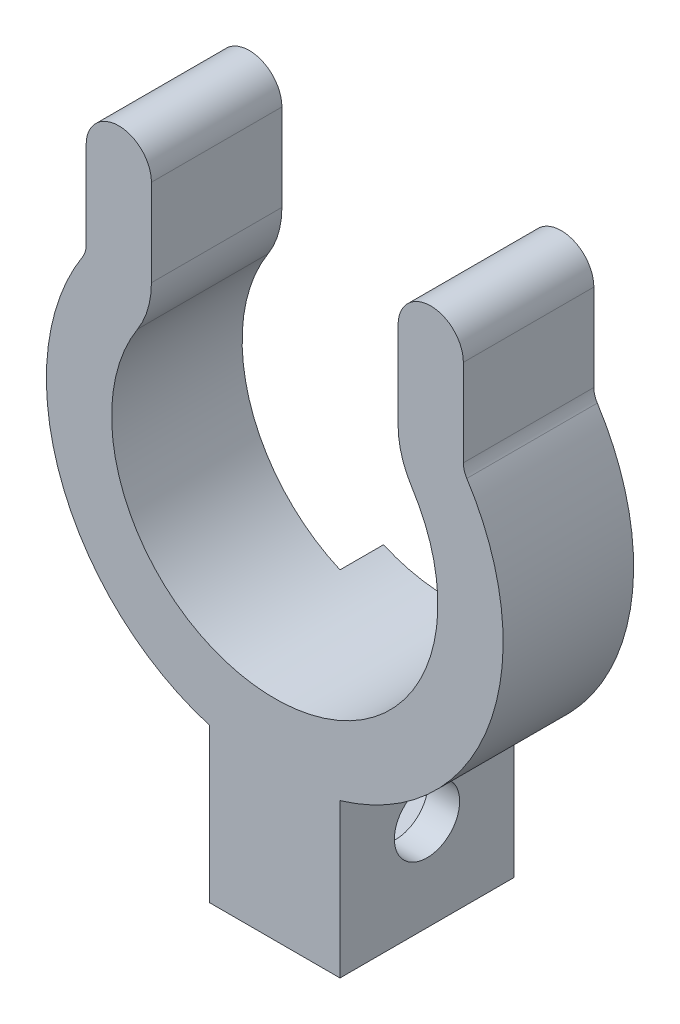
ISO-10303-21;
HEADER;
FILE_DESCRIPTION(('STEP AP214'),'2;1');
FILE_NAME('part.step','',(''),(''),'','','');
FILE_SCHEMA(('AUTOMOTIVE_DESIGN { 1 0 10303 214 1 1 1 1 }'));
ENDSEC;
DATA;
#1=APPLICATION_CONTEXT('core data for automotive mechanical design processes');
#2=APPLICATION_PROTOCOL_DEFINITION('international standard','automotive_design',2000,#1);
#3=PRODUCT_CONTEXT('',#1,'mechanical');
#4=PRODUCT('Part','Part','',(#3));
#5=PRODUCT_RELATED_PRODUCT_CATEGORY('part','',(#4));
#6=PRODUCT_DEFINITION_FORMATION('','',#4);
#7=PRODUCT_DEFINITION_CONTEXT('part definition',#1,'design');
#8=PRODUCT_DEFINITION('design','',#6,#7);
#9=PRODUCT_DEFINITION_SHAPE('','',#8);
#10=(LENGTH_UNIT() NAMED_UNIT(*) SI_UNIT(.MILLI.,.METRE.));
#11=(NAMED_UNIT(*) PLANE_ANGLE_UNIT() SI_UNIT($,.RADIAN.));
#12=(NAMED_UNIT(*) SI_UNIT($,.STERADIAN.) SOLID_ANGLE_UNIT());
#13=UNCERTAINTY_MEASURE_WITH_UNIT(LENGTH_MEASURE(1.E-05),#10,'distance_accuracy_value','');
#14=(GEOMETRIC_REPRESENTATION_CONTEXT(3) GLOBAL_UNCERTAINTY_ASSIGNED_CONTEXT((#13)) GLOBAL_UNIT_ASSIGNED_CONTEXT((#10,
#11,#12)) REPRESENTATION_CONTEXT('',''));
#15=CARTESIAN_POINT('',(0.,0.,0.));
#16=DIRECTION('',(0.,0.,1.));
#17=DIRECTION('',(1.,0.,0.));
#18=AXIS2_PLACEMENT_3D('',#15,#16,#17);
#19=CARTESIAN_POINT('',(0.,0.,6.));
#20=DIRECTION('',(0.,0.,-1.));
#21=DIRECTION('',(-1.,0.,0.));
#22=AXIS2_PLACEMENT_3D('',#19,#20,#21);
#23=CYLINDRICAL_SURFACE('',#22,10.5);
#24=CARTESIAN_POINT('',(0.,0.,6.));
#25=DIRECTION('',(0.,0.,1.));
#26=DIRECTION('',(1.,0.,0.));
#27=AXIS2_PLACEMENT_3D('',#24,#25,#26);
#28=CIRCLE('',#27,10.5);
#29=CARTESIAN_POINT('',(3.,-10.0623058987491,6.));
#30=VERTEX_POINT('',#29);
#31=CARTESIAN_POINT('',(8.83026219841009,5.68123837797093,6.));
#32=VERTEX_POINT('',#31);
#33=EDGE_CURVE('E70',#30,#32,#28,.T.);
#34=ORIENTED_EDGE('',*,*,#33,.F.);
#35=DIRECTION('',(0.,0.,-1.));
#36=VECTOR('',#35,1.);
#37=CARTESIAN_POINT('',(3.,-10.0623058987491,6.));
#38=LINE('',#37,#36);
#39=CARTESIAN_POINT('',(3.,-10.0623058987491,0.));
#40=VERTEX_POINT('',#39);
#41=EDGE_CURVE('E293',#30,#40,#38,.T.);
#42=ORIENTED_EDGE('',*,*,#41,.T.);
#43=CARTESIAN_POINT('',(0.,0.,0.));
#44=DIRECTION('',(0.,0.,1.));
#45=DIRECTION('',(1.,0.,0.));
#46=AXIS2_PLACEMENT_3D('',#43,#44,#45);
#47=CIRCLE('',#46,10.5);
#48=CARTESIAN_POINT('',(8.83026219841009,5.68123837797093,0.));
#49=VERTEX_POINT('',#48);
#50=EDGE_CURVE('E360',#40,#49,#47,.T.);
#51=ORIENTED_EDGE('',*,*,#50,.T.);
#52=DIRECTION('',(0.,0.,-1.));
#53=VECTOR('',#52,1.);
#54=CARTESIAN_POINT('',(8.83026219841009,5.68123837797093,6.));
#55=LINE('',#54,#53);
#56=EDGE_CURVE('E391',#32,#49,#55,.T.);
#57=ORIENTED_EDGE('',*,*,#56,.F.);
#58=EDGE_LOOP('',(#34,#42,#51,#57));
#59=FACE_BOUND('',#58,.T.);
#60=ADVANCED_FACE('F45',(#59),#23,.T.);
#61=CARTESIAN_POINT('',(9.67123955063962,6.22230869968245,0.));
#62=DIRECTION('',(0.,0.,-1.));
#63=DIRECTION('',(-1.,0.,0.));
#64=AXIS2_PLACEMENT_3D('',#61,#62,#63);
#65=PLANE('',#64);
#66=DIRECTION('',(0.,-1.,0.));
#67=VECTOR('',#66,1.);
#68=CARTESIAN_POINT('',(3.,6.22230869968245,0.));
#69=LINE('',#68,#67);
#70=CARTESIAN_POINT('',(3.,-6.87386354243376,0.));
#71=VERTEX_POINT('',#70);
#72=EDGE_CURVE('E11',#71,#40,#69,.T.);
#73=ORIENTED_EDGE('',*,*,#72,.F.);
#74=CARTESIAN_POINT('',(0.,0.,0.));
#75=DIRECTION('',(0.,0.,-1.));
#76=DIRECTION('',(1.,0.,0.));
#77=AXIS2_PLACEMENT_3D('',#74,#75,#76);
#78=CIRCLE('',#77,7.5);
#79=CARTESIAN_POINT('',(6.30733014172149,4.05802741283638,0.));
#80=VERTEX_POINT('',#79);
#81=EDGE_CURVE('E341',#80,#71,#78,.T.);
#82=ORIENTED_EDGE('',*,*,#81,.F.);
#83=CARTESIAN_POINT('',(9.67123955063962,6.22230869968245,0.));
#84=DIRECTION('',(0.,0.,1.));
#85=DIRECTION('',(-1.,0.,0.));
#86=AXIS2_PLACEMENT_3D('',#83,#84,#85);
#87=CIRCLE('',#86,4.);
#88=CARTESIAN_POINT('',(5.67123955063962,6.22230869968245,0.));
#89=VERTEX_POINT('',#88);
#90=EDGE_CURVE('E296',#89,#80,#87,.T.);
#91=ORIENTED_EDGE('',*,*,#90,.F.);
#92=DIRECTION('',(0.,-1.,0.));
#93=VECTOR('',#92,1.);
#94=CARTESIAN_POINT('',(5.67123955063962,6.22230869968245,0.));
#95=LINE('',#94,#93);
#96=CARTESIAN_POINT('',(5.67123955063962,10.2223086996825,0.));
#97=VERTEX_POINT('',#96);
#98=EDGE_CURVE('E302',#97,#89,#95,.T.);
#99=ORIENTED_EDGE('',*,*,#98,.F.);
#100=CARTESIAN_POINT('',(7.17123955063962,10.2223086996825,0.));
#101=DIRECTION('',(0.,0.,1.));
#102=DIRECTION('',(1.,0.,0.));
#103=AXIS2_PLACEMENT_3D('',#100,#101,#102);
#104=CIRCLE('',#103,1.5);
#105=CARTESIAN_POINT('',(8.67123955063962,10.2223086996825,0.));
#106=VERTEX_POINT('',#105);
#107=EDGE_CURVE('E371',#106,#97,#104,.T.);
#108=ORIENTED_EDGE('',*,*,#107,.F.);
#109=DIRECTION('',(0.,1.,0.));
#110=VECTOR('',#109,1.);
#111=CARTESIAN_POINT('',(8.67123955063962,6.22230869968245,0.));
#112=LINE('',#111,#110);
#113=CARTESIAN_POINT('',(8.67123955063962,6.22230869968245,0.));
#114=VERTEX_POINT('',#113);
#115=EDGE_CURVE('E368',#114,#106,#112,.T.);
#116=ORIENTED_EDGE('',*,*,#115,.F.);
#117=CARTESIAN_POINT('',(9.67123955063962,6.22230869968245,0.));
#118=DIRECTION('',(0.,0.,-1.));
#119=DIRECTION('',(-1.,0.,0.));
#120=AXIS2_PLACEMENT_3D('',#117,#118,#119);
#121=CIRCLE('',#120,1.);
#122=EDGE_CURVE('E365',#49,#114,#121,.T.);
#123=ORIENTED_EDGE('',*,*,#122,.F.);
#124=ORIENTED_EDGE('',*,*,#50,.F.);
#125=EDGE_LOOP('',(#73,#82,#91,#99,#108,#116,#123,#124));
#126=FACE_BOUND('',#125,.T.);
#127=ADVANCED_FACE('F484',(#126),#65,.T.);
#128=CARTESIAN_POINT('',(9.67123955063962,6.22230869968245,6.));
#129=DIRECTION('',(0.,0.,-1.));
#130=DIRECTION('',(-1.,0.,0.));
#131=AXIS2_PLACEMENT_3D('',#128,#129,#130);
#132=CYLINDRICAL_SURFACE('',#131,4.);
#133=ORIENTED_EDGE('',*,*,#90,.T.);
#134=DIRECTION('',(0.,0.,-1.));
#135=VECTOR('',#134,1.);
#136=CARTESIAN_POINT('',(6.30733014172149,4.05802741283638,6.));
#137=LINE('',#136,#135);
#138=CARTESIAN_POINT('',(6.30733014172149,4.05802741283638,6.));
#139=VERTEX_POINT('',#138);
#140=EDGE_CURVE('E419',#139,#80,#137,.T.);
#141=ORIENTED_EDGE('',*,*,#140,.F.);
#142=CARTESIAN_POINT('',(9.67123955063962,6.22230869968245,6.));
#143=DIRECTION('',(0.,0.,1.));
#144=DIRECTION('',(-1.,0.,0.));
#145=AXIS2_PLACEMENT_3D('',#142,#143,#144);
#146=CIRCLE('',#145,4.);
#147=CARTESIAN_POINT('',(5.67123955063962,6.22230869968245,6.));
#148=VERTEX_POINT('',#147);
#149=EDGE_CURVE('E297',#148,#139,#146,.T.);
#150=ORIENTED_EDGE('',*,*,#149,.F.);
#151=DIRECTION('',(0.,0.,-1.));
#152=VECTOR('',#151,1.);
#153=CARTESIAN_POINT('',(5.67123955063962,6.22230869968245,6.));
#154=LINE('',#153,#152);
#155=EDGE_CURVE('E336',#148,#89,#154,.T.);
#156=ORIENTED_EDGE('',*,*,#155,.T.);
#157=EDGE_LOOP('',(#133,#141,#150,#156));
#158=FACE_BOUND('',#157,.T.);
#159=ADVANCED_FACE('F47',(#158),#132,.T.);
#160=CARTESIAN_POINT('',(0.,0.,6.));
#161=DIRECTION('',(0.,0.,-1.));
#162=DIRECTION('',(-1.,0.,0.));
#163=AXIS2_PLACEMENT_3D('',#160,#161,#162);
#164=CYLINDRICAL_SURFACE('',#163,7.5);
#165=DIRECTION('',(0.,0.,-1.));
#166=VECTOR('',#165,1.);
#167=CARTESIAN_POINT('',(-6.30733014172149,4.05802741283638,6.));
#168=LINE('',#167,#166);
#169=CARTESIAN_POINT('',(-6.30733014172149,4.05802741283638,6.));
#170=VERTEX_POINT('',#169);
#171=CARTESIAN_POINT('',(-6.30733014172149,4.05802741283638,0.));
#172=VERTEX_POINT('',#171);
#173=EDGE_CURVE('E415',#170,#172,#168,.T.);
#174=ORIENTED_EDGE('',*,*,#173,.F.);
#175=CARTESIAN_POINT('',(0.,0.,6.));
#176=DIRECTION('',(0.,0.,-1.));
#177=DIRECTION('',(1.,0.,0.));
#178=AXIS2_PLACEMENT_3D('',#175,#176,#177);
#179=CIRCLE('',#178,7.5);
#180=EDGE_CURVE('E301',#139,#170,#179,.T.);
#181=ORIENTED_EDGE('',*,*,#180,.F.);
#182=ORIENTED_EDGE('',*,*,#140,.T.);
#183=ORIENTED_EDGE('',*,*,#81,.T.);
#184=DIRECTION('',(0.,0.,1.));
#185=VECTOR('',#184,1.);
#186=CARTESIAN_POINT('',(3.,-6.87386354243376,-2.));
#187=LINE('',#186,#185);
#188=CARTESIAN_POINT('',(3.,-6.87386354243376,-2.));
#189=VERTEX_POINT('',#188);
#190=EDGE_CURVE('E275',#189,#71,#187,.T.);
#191=ORIENTED_EDGE('',*,*,#190,.F.);
#192=CARTESIAN_POINT('',(0.,0.,-2.));
#193=DIRECTION('',(0.,0.,-1.));
#194=DIRECTION('',(1.,0.,0.));
#195=AXIS2_PLACEMENT_3D('',#192,#193,#194);
#196=CIRCLE('',#195,7.5);
#197=CARTESIAN_POINT('',(-3.,-6.87386354243376,-2.));
#198=VERTEX_POINT('',#197);
#199=EDGE_CURVE('E250',#189,#198,#196,.T.);
#200=ORIENTED_EDGE('',*,*,#199,.T.);
#201=DIRECTION('',(0.,0.,1.));
#202=VECTOR('',#201,1.);
#203=CARTESIAN_POINT('',(-3.,-6.87386354243376,-2.));
#204=LINE('',#203,#202);
#205=CARTESIAN_POINT('',(-3.,-6.87386354243376,0.));
#206=VERTEX_POINT('',#205);
#207=EDGE_CURVE('E265',#198,#206,#204,.T.);
#208=ORIENTED_EDGE('',*,*,#207,.T.);
#209=EDGE_CURVE('E340',#206,#172,#78,.T.);
#210=ORIENTED_EDGE('',*,*,#209,.T.);
#211=EDGE_LOOP('',(#174,#181,#182,#183,#191,#200,#208,#210));
#212=FACE_BOUND('',#211,.T.);
#213=ADVANCED_FACE('F434',(#212),#164,.F.);
#214=CARTESIAN_POINT('',(-9.67123955063962,6.22230869968245,6.));
#215=DIRECTION('',(0.,0.,-1.));
#216=DIRECTION('',(-1.,0.,0.));
#217=AXIS2_PLACEMENT_3D('',#214,#215,#216);
#218=CYLINDRICAL_SURFACE('',#217,4.);
#219=CARTESIAN_POINT('',(-9.67123955063962,6.22230869968245,0.));
#220=DIRECTION('',(0.,0.,1.));
#221=DIRECTION('',(1.,0.,0.));
#222=AXIS2_PLACEMENT_3D('',#219,#220,#221);
#223=CIRCLE('',#222,4.);
#224=CARTESIAN_POINT('',(-5.67123955063962,6.22230869968245,0.));
#225=VERTEX_POINT('',#224);
#226=EDGE_CURVE('E345',#172,#225,#223,.T.);
#227=ORIENTED_EDGE('',*,*,#226,.T.);
#228=DIRECTION('',(0.,0.,-1.));
#229=VECTOR('',#228,1.);
#230=CARTESIAN_POINT('',(-5.67123955063962,6.22230869968245,6.));
#231=LINE('',#230,#229);
#232=CARTESIAN_POINT('',(-5.67123955063962,6.22230869968245,6.));
#233=VERTEX_POINT('',#232);
#234=EDGE_CURVE('E411',#233,#225,#231,.T.);
#235=ORIENTED_EDGE('',*,*,#234,.F.);
#236=CARTESIAN_POINT('',(-9.67123955063962,6.22230869968245,6.));
#237=DIRECTION('',(0.,0.,1.));
#238=DIRECTION('',(1.,0.,0.));
#239=AXIS2_PLACEMENT_3D('',#236,#237,#238);
#240=CIRCLE('',#239,4.);
#241=EDGE_CURVE('E305',#170,#233,#240,.T.);
#242=ORIENTED_EDGE('',*,*,#241,.F.);
#243=ORIENTED_EDGE('',*,*,#173,.T.);
#244=EDGE_LOOP('',(#227,#235,#242,#243));
#245=FACE_BOUND('',#244,.T.);
#246=ADVANCED_FACE('F475',(#245),#218,.T.);
#247=CARTESIAN_POINT('',(-5.67123955063962,6.22230869968245,6.));
#248=DIRECTION('',(-1.,0.,0.));
#249=DIRECTION('',(0.,0.,1.));
#250=AXIS2_PLACEMENT_3D('',#247,#248,#249);
#251=PLANE('',#250);
#252=DIRECTION('',(0.,1.,0.));
#253=VECTOR('',#252,1.);
#254=CARTESIAN_POINT('',(-5.67123955063962,6.22230869968245,0.));
#255=LINE('',#254,#253);
#256=CARTESIAN_POINT('',(-5.67123955063962,10.2223086996825,0.));
#257=VERTEX_POINT('',#256);
#258=EDGE_CURVE('E348',#225,#257,#255,.T.);
#259=ORIENTED_EDGE('',*,*,#258,.T.);
#260=DIRECTION('',(0.,0.,-1.));
#261=VECTOR('',#260,1.);
#262=CARTESIAN_POINT('',(-5.67123955063962,10.2223086996825,6.));
#263=LINE('',#262,#261);
#264=CARTESIAN_POINT('',(-5.67123955063962,10.2223086996825,6.));
#265=VERTEX_POINT('',#264);
#266=EDGE_CURVE('E407',#265,#257,#263,.T.);
#267=ORIENTED_EDGE('',*,*,#266,.F.);
#268=DIRECTION('',(0.,1.,0.));
#269=VECTOR('',#268,1.);
#270=CARTESIAN_POINT('',(-5.67123955063962,6.22230869968245,6.));
#271=LINE('',#270,#269);
#272=EDGE_CURVE('E308',#233,#265,#271,.T.);
#273=ORIENTED_EDGE('',*,*,#272,.F.);
#274=ORIENTED_EDGE('',*,*,#234,.T.);
#275=EDGE_LOOP('',(#259,#267,#273,#274));
#276=FACE_BOUND('',#275,.T.);
#277=ADVANCED_FACE('F470',(#276),#251,.F.);
#278=CARTESIAN_POINT('',(-7.17123955063962,10.2223086996825,6.));
#279=DIRECTION('',(0.,0.,-1.));
#280=DIRECTION('',(-1.,0.,0.));
#281=AXIS2_PLACEMENT_3D('',#278,#279,#280);
#282=CYLINDRICAL_SURFACE('',#281,1.5);
#283=CARTESIAN_POINT('',(-7.17123955063962,10.2223086996825,0.));
#284=DIRECTION('',(0.,0.,1.));
#285=DIRECTION('',(-1.,0.,0.));
#286=AXIS2_PLACEMENT_3D('',#283,#284,#285);
#287=CIRCLE('',#286,1.5);
#288=CARTESIAN_POINT('',(-8.67123955063962,10.2223086996825,0.));
#289=VERTEX_POINT('',#288);
#290=EDGE_CURVE('E351',#257,#289,#287,.T.);
#291=ORIENTED_EDGE('',*,*,#290,.T.);
#292=DIRECTION('',(0.,0.,-1.));
#293=VECTOR('',#292,1.);
#294=CARTESIAN_POINT('',(-8.67123955063962,10.2223086996825,6.));
#295=LINE('',#294,#293);
#296=CARTESIAN_POINT('',(-8.67123955063962,10.2223086996825,6.));
#297=VERTEX_POINT('',#296);
#298=EDGE_CURVE('E403',#297,#289,#295,.T.);
#299=ORIENTED_EDGE('',*,*,#298,.F.);
#300=CARTESIAN_POINT('',(-7.17123955063962,10.2223086996825,6.));
#301=DIRECTION('',(0.,0.,1.));
#302=DIRECTION('',(-1.,0.,0.));
#303=AXIS2_PLACEMENT_3D('',#300,#301,#302);
#304=CIRCLE('',#303,1.5);
#305=EDGE_CURVE('E311',#265,#297,#304,.T.);
#306=ORIENTED_EDGE('',*,*,#305,.F.);
#307=ORIENTED_EDGE('',*,*,#266,.T.);
#308=EDGE_LOOP('',(#291,#299,#306,#307));
#309=FACE_BOUND('',#308,.T.);
#310=ADVANCED_FACE('F465',(#309),#282,.T.);
#311=CARTESIAN_POINT('',(-8.67123955063962,6.22230869968245,6.));
#312=DIRECTION('',(1.,0.,0.));
#313=DIRECTION('',(0.,0.,-1.));
#314=AXIS2_PLACEMENT_3D('',#311,#312,#313);
#315=PLANE('',#314);
#316=DIRECTION('',(0.,-1.,0.));
#317=VECTOR('',#316,1.);
#318=CARTESIAN_POINT('',(-8.67123955063962,6.22230869968245,0.));
#319=LINE('',#318,#317);
#320=CARTESIAN_POINT('',(-8.67123955063962,6.22230869968245,0.));
#321=VERTEX_POINT('',#320);
#322=EDGE_CURVE('E354',#289,#321,#319,.T.);
#323=ORIENTED_EDGE('',*,*,#322,.T.);
#324=DIRECTION('',(0.,0.,-1.));
#325=VECTOR('',#324,1.);
#326=CARTESIAN_POINT('',(-8.67123955063962,6.22230869968245,6.));
#327=LINE('',#326,#325);
#328=CARTESIAN_POINT('',(-8.67123955063962,6.22230869968245,6.));
#329=VERTEX_POINT('',#328);
#330=EDGE_CURVE('E399',#329,#321,#327,.T.);
#331=ORIENTED_EDGE('',*,*,#330,.F.);
#332=DIRECTION('',(0.,-1.,0.));
#333=VECTOR('',#332,1.);
#334=CARTESIAN_POINT('',(-8.67123955063962,6.22230869968245,6.));
#335=LINE('',#334,#333);
#336=EDGE_CURVE('E314',#297,#329,#335,.T.);
#337=ORIENTED_EDGE('',*,*,#336,.F.);
#338=ORIENTED_EDGE('',*,*,#298,.T.);
#339=EDGE_LOOP('',(#323,#331,#337,#338));
#340=FACE_BOUND('',#339,.T.);
#341=ADVANCED_FACE('F461',(#340),#315,.F.);
#342=CARTESIAN_POINT('',(-9.67123955063962,6.22230869968245,6.));
#343=DIRECTION('',(0.,0.,-1.));
#344=DIRECTION('',(-1.,0.,0.));
#345=AXIS2_PLACEMENT_3D('',#342,#343,#344);
#346=CYLINDRICAL_SURFACE('',#345,1.);
#347=CARTESIAN_POINT('',(-9.67123955063962,6.22230869968245,0.));
#348=DIRECTION('',(0.,0.,-1.));
#349=DIRECTION('',(1.,0.,0.));
#350=AXIS2_PLACEMENT_3D('',#347,#348,#349);
#351=CIRCLE('',#350,1.);
#352=CARTESIAN_POINT('',(-8.83026219841009,5.68123837797093,0.));
#353=VERTEX_POINT('',#352);
#354=EDGE_CURVE('E357',#321,#353,#351,.T.);
#355=ORIENTED_EDGE('',*,*,#354,.T.);
#356=DIRECTION('',(0.,0.,-1.));
#357=VECTOR('',#356,1.);
#358=CARTESIAN_POINT('',(-8.83026219841009,5.68123837797093,6.));
#359=LINE('',#358,#357);
#360=CARTESIAN_POINT('',(-8.83026219841009,5.68123837797093,6.));
#361=VERTEX_POINT('',#360);
#362=EDGE_CURVE('E395',#361,#353,#359,.T.);
#363=ORIENTED_EDGE('',*,*,#362,.F.);
#364=CARTESIAN_POINT('',(-9.67123955063962,6.22230869968245,6.));
#365=DIRECTION('',(0.,0.,-1.));
#366=DIRECTION('',(1.,0.,0.));
#367=AXIS2_PLACEMENT_3D('',#364,#365,#366);
#368=CIRCLE('',#367,1.);
#369=EDGE_CURVE('E317',#329,#361,#368,.T.);
#370=ORIENTED_EDGE('',*,*,#369,.F.);
#371=ORIENTED_EDGE('',*,*,#330,.T.);
#372=EDGE_LOOP('',(#355,#363,#370,#371));
#373=FACE_BOUND('',#372,.T.);
#374=ADVANCED_FACE('F457',(#373),#346,.F.);
#375=CARTESIAN_POINT('',(-3.,-10.0623058987491,0.));
#376=VERTEX_POINT('',#375);
#377=EDGE_CURVE('E361',#353,#376,#47,.T.);
#378=ORIENTED_EDGE('',*,*,#377,.T.);
#379=DIRECTION('',(0.,0.,-1.));
#380=VECTOR('',#379,1.);
#381=CARTESIAN_POINT('',(-3.,-10.0623058987491,6.));
#382=LINE('',#381,#380);
#383=CARTESIAN_POINT('',(-3.,-10.0623058987491,6.));
#384=VERTEX_POINT('',#383);
#385=EDGE_CURVE('E279',#376,#384,#382,.F.);
#386=ORIENTED_EDGE('',*,*,#385,.T.);
#387=EDGE_CURVE('E320',#361,#384,#28,.T.);
#388=ORIENTED_EDGE('',*,*,#387,.F.);
#389=ORIENTED_EDGE('',*,*,#362,.T.);
#390=EDGE_LOOP('',(#378,#386,#388,#389));
#391=FACE_BOUND('',#390,.T.);
#392=ADVANCED_FACE('F451',(#391),#23,.T.);
#393=CARTESIAN_POINT('',(9.67123955063962,6.22230869968245,6.));
#394=DIRECTION('',(0.,0.,-1.));
#395=DIRECTION('',(-1.,0.,0.));
#396=AXIS2_PLACEMENT_3D('',#393,#394,#395);
#397=CYLINDRICAL_SURFACE('',#396,1.);
#398=ORIENTED_EDGE('',*,*,#122,.T.);
#399=DIRECTION('',(0.,0.,-1.));
#400=VECTOR('',#399,1.);
#401=CARTESIAN_POINT('',(8.67123955063962,6.22230869968245,6.));
#402=LINE('',#401,#400);
#403=CARTESIAN_POINT('',(8.67123955063962,6.22230869968245,6.));
#404=VERTEX_POINT('',#403);
#405=EDGE_CURVE('E387',#404,#114,#402,.T.);
#406=ORIENTED_EDGE('',*,*,#405,.F.);
#407=CARTESIAN_POINT('',(9.67123955063962,6.22230869968245,6.));
#408=DIRECTION('',(0.,0.,-1.));
#409=DIRECTION('',(-1.,0.,0.));
#410=AXIS2_PLACEMENT_3D('',#407,#408,#409);
#411=CIRCLE('',#410,1.);
#412=EDGE_CURVE('E324',#32,#404,#411,.T.);
#413=ORIENTED_EDGE('',*,*,#412,.F.);
#414=ORIENTED_EDGE('',*,*,#56,.T.);
#415=EDGE_LOOP('',(#398,#406,#413,#414));
#416=FACE_BOUND('',#415,.T.);
#417=ADVANCED_FACE('F497',(#416),#397,.F.);
#418=CARTESIAN_POINT('',(8.67123955063962,6.22230869968245,6.));
#419=DIRECTION('',(-1.,0.,0.));
#420=DIRECTION('',(0.,0.,1.));
#421=AXIS2_PLACEMENT_3D('',#418,#419,#420);
#422=PLANE('',#421);
#423=ORIENTED_EDGE('',*,*,#115,.T.);
#424=DIRECTION('',(0.,0.,-1.));
#425=VECTOR('',#424,1.);
#426=CARTESIAN_POINT('',(8.67123955063962,10.2223086996825,6.));
#427=LINE('',#426,#425);
#428=CARTESIAN_POINT('',(8.67123955063962,10.2223086996825,6.));
#429=VERTEX_POINT('',#428);
#430=EDGE_CURVE('E383',#429,#106,#427,.T.);
#431=ORIENTED_EDGE('',*,*,#430,.F.);
#432=DIRECTION('',(0.,1.,0.));
#433=VECTOR('',#432,1.);
#434=CARTESIAN_POINT('',(8.67123955063962,6.22230869968245,6.));
#435=LINE('',#434,#433);
#436=EDGE_CURVE('E327',#404,#429,#435,.T.);
#437=ORIENTED_EDGE('',*,*,#436,.F.);
#438=ORIENTED_EDGE('',*,*,#405,.T.);
#439=EDGE_LOOP('',(#423,#431,#437,#438));
#440=FACE_BOUND('',#439,.T.);
#441=ADVANCED_FACE('F501',(#440),#422,.F.);
#442=CARTESIAN_POINT('',(7.17123955063962,10.2223086996825,6.));
#443=DIRECTION('',(0.,0.,-1.));
#444=DIRECTION('',(-1.,0.,0.));
#445=AXIS2_PLACEMENT_3D('',#442,#443,#444);
#446=CYLINDRICAL_SURFACE('',#445,1.5);
#447=ORIENTED_EDGE('',*,*,#107,.T.);
#448=DIRECTION('',(0.,0.,-1.));
#449=VECTOR('',#448,1.);
#450=CARTESIAN_POINT('',(5.67123955063962,10.2223086996825,6.));
#451=LINE('',#450,#449);
#452=CARTESIAN_POINT('',(5.67123955063962,10.2223086996825,6.));
#453=VERTEX_POINT('',#452);
#454=EDGE_CURVE('E379',#453,#97,#451,.T.);
#455=ORIENTED_EDGE('',*,*,#454,.F.);
#456=CARTESIAN_POINT('',(7.17123955063962,10.2223086996825,6.));
#457=DIRECTION('',(0.,0.,1.));
#458=DIRECTION('',(1.,0.,0.));
#459=AXIS2_PLACEMENT_3D('',#456,#457,#458);
#460=CIRCLE('',#459,1.5);
#461=EDGE_CURVE('E330',#429,#453,#460,.T.);
#462=ORIENTED_EDGE('',*,*,#461,.F.);
#463=ORIENTED_EDGE('',*,*,#430,.T.);
#464=EDGE_LOOP('',(#447,#455,#462,#463));
#465=FACE_BOUND('',#464,.T.);
#466=ADVANCED_FACE('F505',(#465),#446,.T.);
#467=CARTESIAN_POINT('',(5.67123955063962,6.22230869968245,6.));
#468=DIRECTION('',(1.,0.,0.));
#469=DIRECTION('',(0.,0.,-1.));
#470=AXIS2_PLACEMENT_3D('',#467,#468,#469);
#471=PLANE('',#470);
#472=ORIENTED_EDGE('',*,*,#98,.T.);
#473=ORIENTED_EDGE('',*,*,#155,.F.);
#474=DIRECTION('',(0.,-1.,0.));
#475=VECTOR('',#474,1.);
#476=CARTESIAN_POINT('',(5.67123955063962,6.22230869968245,6.));
#477=LINE('',#476,#475);
#478=EDGE_CURVE('E333',#453,#148,#477,.T.);
#479=ORIENTED_EDGE('',*,*,#478,.F.);
#480=ORIENTED_EDGE('',*,*,#454,.T.);
#481=EDGE_LOOP('',(#472,#473,#479,#480));
#482=FACE_BOUND('',#481,.T.);
#483=ADVANCED_FACE('F507',(#482),#471,.F.);
#484=CARTESIAN_POINT('',(9.67123955063962,6.22230869968245,6.));
#485=DIRECTION('',(0.,0.,-1.));
#486=DIRECTION('',(-1.,0.,0.));
#487=AXIS2_PLACEMENT_3D('',#484,#485,#486);
#488=PLANE('',#487);
#489=ORIENTED_EDGE('',*,*,#387,.T.);
#490=DIRECTION('',(0.,-1.,0.));
#491=VECTOR('',#490,1.);
#492=CARTESIAN_POINT('',(-3.,-14.1261364575662,6.));
#493=LINE('',#492,#491);
#494=CARTESIAN_POINT('',(-3.,-17.1261364575662,6.));
#495=VERTEX_POINT('',#494);
#496=EDGE_CURVE('E244',#384,#495,#493,.T.);
#497=ORIENTED_EDGE('',*,*,#496,.T.);
#498=DIRECTION('',(1.,0.,0.));
#499=VECTOR('',#498,1.);
#500=CARTESIAN_POINT('',(-3.,-17.1261364575662,6.));
#501=LINE('',#500,#499);
#502=CARTESIAN_POINT('',(3.,-17.1261364575662,6.));
#503=VERTEX_POINT('',#502);
#504=EDGE_CURVE('E268',#495,#503,#501,.T.);
#505=ORIENTED_EDGE('',*,*,#504,.T.);
#506=DIRECTION('',(0.,1.,0.));
#507=VECTOR('',#506,1.);
#508=CARTESIAN_POINT('',(3.,-14.1261364575662,6.));
#509=LINE('',#508,#507);
#510=EDGE_CURVE('E255',#503,#30,#509,.T.);
#511=ORIENTED_EDGE('',*,*,#510,.T.);
#512=ORIENTED_EDGE('',*,*,#33,.T.);
#513=ORIENTED_EDGE('',*,*,#412,.T.);
#514=ORIENTED_EDGE('',*,*,#436,.T.);
#515=ORIENTED_EDGE('',*,*,#461,.T.);
#516=ORIENTED_EDGE('',*,*,#478,.T.);
#517=ORIENTED_EDGE('',*,*,#149,.T.);
#518=ORIENTED_EDGE('',*,*,#180,.T.);
#519=ORIENTED_EDGE('',*,*,#241,.T.);
#520=ORIENTED_EDGE('',*,*,#272,.T.);
#521=ORIENTED_EDGE('',*,*,#305,.T.);
#522=ORIENTED_EDGE('',*,*,#336,.T.);
#523=ORIENTED_EDGE('',*,*,#369,.T.);
#524=EDGE_LOOP('',(#489,#497,#505,#511,#512,#513,#514,#515,#516,#517,#518,#519,#520,#521,#522,#523));
#525=FACE_BOUND('',#524,.T.);
#526=ADVANCED_FACE('F446',(#525),#488,.F.);
#527=DIRECTION('',(0.,1.,0.));
#528=VECTOR('',#527,1.);
#529=CARTESIAN_POINT('',(-3.,6.22230869968245,0.));
#530=LINE('',#529,#528);
#531=EDGE_CURVE('E55',#376,#206,#530,.T.);
#532=ORIENTED_EDGE('',*,*,#531,.F.);
#533=ORIENTED_EDGE('',*,*,#377,.F.);
#534=ORIENTED_EDGE('',*,*,#354,.F.);
#535=ORIENTED_EDGE('',*,*,#322,.F.);
#536=ORIENTED_EDGE('',*,*,#290,.F.);
#537=ORIENTED_EDGE('',*,*,#258,.F.);
#538=ORIENTED_EDGE('',*,*,#226,.F.);
#539=ORIENTED_EDGE('',*,*,#209,.F.);
#540=EDGE_LOOP('',(#532,#533,#534,#535,#536,#537,#538,#539));
#541=FACE_BOUND('',#540,.T.);
#542=ADVANCED_FACE('F453',(#541),#65,.T.);
#543=CARTESIAN_POINT('',(3.,-14.1261364575662,-2.));
#544=DIRECTION('',(1.,0.,0.));
#545=DIRECTION('',(0.,0.,-1.));
#546=AXIS2_PLACEMENT_3D('',#543,#544,#545);
#547=PLANE('',#546);
#548=CARTESIAN_POINT('',(3.,-12.8423058987491,2.));
#549=DIRECTION('',(1.,0.,0.));
#550=DIRECTION('',(0.,0.,-1.));
#551=AXIS2_PLACEMENT_3D('',#548,#549,#550);
#552=CIRCLE('',#551,1.5);
#553=CARTESIAN_POINT('',(3.,-12.8423058987491,0.5));
#554=VERTEX_POINT('',#553);
#555=EDGE_CURVE('E226',#554,#554,#552,.T.);
#556=ORIENTED_EDGE('',*,*,#555,.F.);
#557=EDGE_LOOP('',(#556));
#558=FACE_BOUND('',#557,.T.);
#559=ORIENTED_EDGE('',*,*,#41,.F.);
#560=ORIENTED_EDGE('',*,*,#510,.F.);
#561=DIRECTION('',(0.,0.,1.));
#562=VECTOR('',#561,1.);
#563=CARTESIAN_POINT('',(3.,-17.1261364575662,-2.));
#564=LINE('',#563,#562);
#565=CARTESIAN_POINT('',(3.,-17.1261364575662,-2.));
#566=VERTEX_POINT('',#565);
#567=EDGE_CURVE('E280',#566,#503,#564,.T.);
#568=ORIENTED_EDGE('',*,*,#567,.F.);
#569=DIRECTION('',(0.,1.,0.));
#570=VECTOR('',#569,1.);
#571=CARTESIAN_POINT('',(3.,-14.1261364575662,-2.));
#572=LINE('',#571,#570);
#573=EDGE_CURVE('E262',#566,#189,#572,.T.);
#574=ORIENTED_EDGE('',*,*,#573,.T.);
#575=ORIENTED_EDGE('',*,*,#190,.T.);
#576=ORIENTED_EDGE('',*,*,#72,.T.);
#577=EDGE_LOOP('',(#559,#560,#568,#574,#575,#576));
#578=FACE_BOUND('',#577,.T.);
#579=ADVANCED_FACE('F488',(#558,#578),#547,.T.);
#580=CARTESIAN_POINT('',(-3.,-14.1261364575662,-2.));
#581=DIRECTION('',(-1.,0.,0.));
#582=DIRECTION('',(0.,0.,1.));
#583=AXIS2_PLACEMENT_3D('',#580,#581,#582);
#584=PLANE('',#583);
#585=CARTESIAN_POINT('',(-3.,-12.8423058987491,2.));
#586=DIRECTION('',(-1.,0.,0.));
#587=DIRECTION('',(0.,0.,1.));
#588=AXIS2_PLACEMENT_3D('',#585,#586,#587);
#589=CIRCLE('',#588,1.5);
#590=CARTESIAN_POINT('',(-3.,-12.8423058987491,3.5));
#591=VERTEX_POINT('',#590);
#592=EDGE_CURVE('E744',#591,#591,#589,.T.);
#593=ORIENTED_EDGE('',*,*,#592,.F.);
#594=EDGE_LOOP('',(#593));
#595=FACE_BOUND('',#594,.T.);
#596=ORIENTED_EDGE('',*,*,#385,.F.);
#597=ORIENTED_EDGE('',*,*,#531,.T.);
#598=ORIENTED_EDGE('',*,*,#207,.F.);
#599=DIRECTION('',(0.,-1.,0.));
#600=VECTOR('',#599,1.);
#601=CARTESIAN_POINT('',(-3.,-14.1261364575662,-2.));
#602=LINE('',#601,#600);
#603=CARTESIAN_POINT('',(-3.,-17.1261364575662,-2.));
#604=VERTEX_POINT('',#603);
#605=EDGE_CURVE('E254',#198,#604,#602,.T.);
#606=ORIENTED_EDGE('',*,*,#605,.T.);
#607=DIRECTION('',(0.,0.,1.));
#608=VECTOR('',#607,1.);
#609=CARTESIAN_POINT('',(-3.,-17.1261364575662,-2.));
#610=LINE('',#609,#608);
#611=EDGE_CURVE('E284',#604,#495,#610,.T.);
#612=ORIENTED_EDGE('',*,*,#611,.T.);
#613=ORIENTED_EDGE('',*,*,#496,.F.);
#614=EDGE_LOOP('',(#596,#597,#598,#606,#612,#613));
#615=FACE_BOUND('',#614,.T.);
#616=ADVANCED_FACE('F427',(#595,#615),#584,.T.);
#617=CARTESIAN_POINT('',(-3.,-17.1261364575662,-2.));
#618=DIRECTION('',(0.,-1.,0.));
#619=DIRECTION('',(1.,0.,0.));
#620=AXIS2_PLACEMENT_3D('',#617,#618,#619);
#621=PLANE('',#620);
#622=ORIENTED_EDGE('',*,*,#504,.F.);
#623=ORIENTED_EDGE('',*,*,#611,.F.);
#624=DIRECTION('',(1.,0.,0.));
#625=VECTOR('',#624,1.);
#626=CARTESIAN_POINT('',(-3.,-17.1261364575662,-2.));
#627=LINE('',#626,#625);
#628=EDGE_CURVE('E258',#604,#566,#627,.T.);
#629=ORIENTED_EDGE('',*,*,#628,.T.);
#630=ORIENTED_EDGE('',*,*,#567,.T.);
#631=EDGE_LOOP('',(#622,#623,#629,#630));
#632=FACE_BOUND('',#631,.T.);
#633=ADVANCED_FACE('F444',(#632),#621,.T.);
#634=CARTESIAN_POINT('',(0.,0.,-2.));
#635=DIRECTION('',(0.,0.,1.));
#636=DIRECTION('',(1.,0.,0.));
#637=AXIS2_PLACEMENT_3D('',#634,#635,#636);
#638=PLANE('',#637);
#639=DIRECTION('',(1.,0.,0.));
#640=VECTOR('',#639,1.);
#641=CARTESIAN_POINT('',(1.55000000000001,-9.79230589874905,-2.));
#642=LINE('',#641,#640);
#643=CARTESIAN_POINT('',(-1.54999999999999,-9.79230589874905,-2.));
#644=VERTEX_POINT('',#643);
#645=CARTESIAN_POINT('',(1.55000000000001,-9.79230589874905,-2.));
#646=VERTEX_POINT('',#645);
#647=EDGE_CURVE('E235',#644,#646,#642,.T.);
#648=ORIENTED_EDGE('',*,*,#647,.F.);
#649=DIRECTION('',(0.,1.,0.));
#650=VECTOR('',#649,1.);
#651=CARTESIAN_POINT('',(-1.54999999999999,-9.79230589874905,-2.));
#652=LINE('',#651,#650);
#653=CARTESIAN_POINT('',(-1.54999999999999,-15.8923058987491,-2.));
#654=VERTEX_POINT('',#653);
#655=EDGE_CURVE('E62',#654,#644,#652,.T.);
#656=ORIENTED_EDGE('',*,*,#655,.F.);
#657=DIRECTION('',(-1.,0.,0.));
#658=VECTOR('',#657,1.);
#659=CARTESIAN_POINT('',(1.55,-15.8923058987491,-2.));
#660=LINE('',#659,#658);
#661=CARTESIAN_POINT('',(1.55,-15.8923058987491,-2.));
#662=VERTEX_POINT('',#661);
#663=EDGE_CURVE('E219',#662,#654,#660,.T.);
#664=ORIENTED_EDGE('',*,*,#663,.F.);
#665=DIRECTION('',(0.,-1.,0.));
#666=VECTOR('',#665,1.);
#667=CARTESIAN_POINT('',(1.55000000000001,-9.79230589874905,-2.));
#668=LINE('',#667,#666);
#669=EDGE_CURVE('E223',#646,#662,#668,.T.);
#670=ORIENTED_EDGE('',*,*,#669,.F.);
#671=EDGE_LOOP('',(#648,#656,#664,#670));
#672=FACE_BOUND('',#671,.T.);
#673=ORIENTED_EDGE('',*,*,#199,.F.);
#674=ORIENTED_EDGE('',*,*,#573,.F.);
#675=ORIENTED_EDGE('',*,*,#628,.F.);
#676=ORIENTED_EDGE('',*,*,#605,.F.);
#677=EDGE_LOOP('',(#673,#674,#675,#676));
#678=FACE_BOUND('',#677,.T.);
#679=ADVANCED_FACE('F439',(#672,#678),#638,.F.);
#680=CARTESIAN_POINT('',(-1.54999999999999,-9.79230589874905,5.5));
#681=DIRECTION('',(-1.,0.,0.));
#682=DIRECTION('',(0.,-1.,0.));
#683=AXIS2_PLACEMENT_3D('',#680,#681,#682);
#684=PLANE('',#683);
#685=CARTESIAN_POINT('',(-1.54999999999999,-12.8423058987491,2.));
#686=DIRECTION('',(-1.,0.,0.));
#687=DIRECTION('',(0.,-1.,0.));
#688=AXIS2_PLACEMENT_3D('',#685,#686,#687);
#689=CIRCLE('',#688,1.5);
#690=CARTESIAN_POINT('',(-1.54999999999999,-14.3423058987491,2.));
#691=VERTEX_POINT('',#690);
#692=EDGE_CURVE('E747',#691,#691,#689,.T.);
#693=ORIENTED_EDGE('',*,*,#692,.T.);
#694=EDGE_LOOP('',(#693));
#695=FACE_BOUND('',#694,.T.);
#696=ORIENTED_EDGE('',*,*,#655,.T.);
#697=DIRECTION('',(0.,0.,-1.));
#698=VECTOR('',#697,1.);
#699=CARTESIAN_POINT('',(-1.54999999999999,-9.79230589874905,5.5));
#700=LINE('',#699,#698);
#701=CARTESIAN_POINT('',(-1.54999999999999,-9.79230589874905,5.5));
#702=VERTEX_POINT('',#701);
#703=EDGE_CURVE('E194',#702,#644,#700,.T.);
#704=ORIENTED_EDGE('',*,*,#703,.F.);
#705=DIRECTION('',(0.,1.,0.));
#706=VECTOR('',#705,1.);
#707=CARTESIAN_POINT('',(-1.54999999999999,-9.79230589874905,5.5));
#708=LINE('',#707,#706);
#709=CARTESIAN_POINT('',(-1.54999999999999,-15.8923058987491,5.5));
#710=VERTEX_POINT('',#709);
#711=EDGE_CURVE('E198',#710,#702,#708,.T.);
#712=ORIENTED_EDGE('',*,*,#711,.F.);
#713=DIRECTION('',(0.,0.,-1.));
#714=VECTOR('',#713,1.);
#715=CARTESIAN_POINT('',(-1.54999999999999,-15.8923058987491,5.5));
#716=LINE('',#715,#714);
#717=EDGE_CURVE('E241',#710,#654,#716,.T.);
#718=ORIENTED_EDGE('',*,*,#717,.T.);
#719=EDGE_LOOP('',(#696,#704,#712,#718));
#720=FACE_BOUND('',#719,.T.);
#721=ADVANCED_FACE('F196',(#695,#720),#684,.F.);
#722=CARTESIAN_POINT('',(1.55,-15.8923058987491,5.5));
#723=DIRECTION('',(0.,-1.,0.));
#724=DIRECTION('',(0.,0.,-1.));
#725=AXIS2_PLACEMENT_3D('',#722,#723,#724);
#726=PLANE('',#725);
#727=ORIENTED_EDGE('',*,*,#663,.T.);
#728=ORIENTED_EDGE('',*,*,#717,.F.);
#729=DIRECTION('',(-1.,0.,0.));
#730=VECTOR('',#729,1.);
#731=CARTESIAN_POINT('',(1.55,-15.8923058987491,5.5));
#732=LINE('',#731,#730);
#733=CARTESIAN_POINT('',(1.55,-15.8923058987491,5.5));
#734=VERTEX_POINT('',#733);
#735=EDGE_CURVE('E205',#734,#710,#732,.T.);
#736=ORIENTED_EDGE('',*,*,#735,.F.);
#737=DIRECTION('',(0.,0.,-1.));
#738=VECTOR('',#737,1.);
#739=CARTESIAN_POINT('',(1.55,-15.8923058987491,5.5));
#740=LINE('',#739,#738);
#741=EDGE_CURVE('E245',#734,#662,#740,.T.);
#742=ORIENTED_EDGE('',*,*,#741,.T.);
#743=EDGE_LOOP('',(#727,#728,#736,#742));
#744=FACE_BOUND('',#743,.T.);
#745=ADVANCED_FACE('F674',(#744),#726,.F.);
#746=CARTESIAN_POINT('',(1.55000000000001,-9.79230589874905,5.5));
#747=DIRECTION('',(1.,0.,0.));
#748=DIRECTION('',(0.,1.,0.));
#749=AXIS2_PLACEMENT_3D('',#746,#747,#748);
#750=PLANE('',#749);
#751=CARTESIAN_POINT('',(1.55000000000001,-12.8423058987491,2.));
#752=DIRECTION('',(1.,0.,0.));
#753=DIRECTION('',(0.,1.,0.));
#754=AXIS2_PLACEMENT_3D('',#751,#752,#753);
#755=CIRCLE('',#754,1.5);
#756=CARTESIAN_POINT('',(1.55000000000001,-11.3423058987491,2.));
#757=VERTEX_POINT('',#756);
#758=EDGE_CURVE('E49',#757,#757,#755,.T.);
#759=ORIENTED_EDGE('',*,*,#758,.T.);
#760=EDGE_LOOP('',(#759));
#761=FACE_BOUND('',#760,.T.);
#762=ORIENTED_EDGE('',*,*,#669,.T.);
#763=ORIENTED_EDGE('',*,*,#741,.F.);
#764=DIRECTION('',(0.,-1.,0.));
#765=VECTOR('',#764,1.);
#766=CARTESIAN_POINT('',(1.55000000000001,-9.79230589874905,5.5));
#767=LINE('',#766,#765);
#768=CARTESIAN_POINT('',(1.55000000000001,-9.79230589874905,5.5));
#769=VERTEX_POINT('',#768);
#770=EDGE_CURVE('E214',#769,#734,#767,.T.);
#771=ORIENTED_EDGE('',*,*,#770,.F.);
#772=DIRECTION('',(0.,0.,-1.));
#773=VECTOR('',#772,1.);
#774=CARTESIAN_POINT('',(1.55000000000001,-9.79230589874905,5.5));
#775=LINE('',#774,#773);
#776=EDGE_CURVE('E204',#769,#646,#775,.T.);
#777=ORIENTED_EDGE('',*,*,#776,.T.);
#778=EDGE_LOOP('',(#762,#763,#771,#777));
#779=FACE_BOUND('',#778,.T.);
#780=ADVANCED_FACE('F683',(#761,#779),#750,.F.);
#781=CARTESIAN_POINT('',(1.55000000000001,-9.79230589874905,5.5));
#782=DIRECTION('',(0.,1.,0.));
#783=DIRECTION('',(0.,0.,1.));
#784=AXIS2_PLACEMENT_3D('',#781,#782,#783);
#785=PLANE('',#784);
#786=ORIENTED_EDGE('',*,*,#647,.T.);
#787=ORIENTED_EDGE('',*,*,#776,.F.);
#788=DIRECTION('',(1.,0.,0.));
#789=VECTOR('',#788,1.);
#790=CARTESIAN_POINT('',(1.55000000000001,-9.79230589874905,5.5));
#791=LINE('',#790,#789);
#792=EDGE_CURVE('E208',#702,#769,#791,.T.);
#793=ORIENTED_EDGE('',*,*,#792,.F.);
#794=ORIENTED_EDGE('',*,*,#703,.T.);
#795=EDGE_LOOP('',(#786,#787,#793,#794));
#796=FACE_BOUND('',#795,.T.);
#797=ADVANCED_FACE('F209',(#796),#785,.F.);
#798=CARTESIAN_POINT('',(0.,0.,5.5));
#799=DIRECTION('',(0.,0.,-1.));
#800=DIRECTION('',(-1.,0.,0.));
#801=AXIS2_PLACEMENT_3D('',#798,#799,#800);
#802=PLANE('',#801);
#803=ORIENTED_EDGE('',*,*,#711,.T.);
#804=ORIENTED_EDGE('',*,*,#792,.T.);
#805=ORIENTED_EDGE('',*,*,#770,.T.);
#806=ORIENTED_EDGE('',*,*,#735,.T.);
#807=EDGE_LOOP('',(#803,#804,#805,#806));
#808=FACE_BOUND('',#807,.T.);
#809=ADVANCED_FACE('F216',(#808),#802,.T.);
#810=CARTESIAN_POINT('',(7.,-12.8423058987491,2.));
#811=DIRECTION('',(-1.,0.,0.));
#812=DIRECTION('',(0.,0.,1.));
#813=AXIS2_PLACEMENT_3D('',#810,#811,#812);
#814=CYLINDRICAL_SURFACE('',#813,1.5);
#815=ORIENTED_EDGE('',*,*,#555,.T.);
#816=EDGE_LOOP('',(#815));
#817=FACE_BOUND('',#816,.T.);
#818=ORIENTED_EDGE('',*,*,#758,.F.);
#819=EDGE_LOOP('',(#818));
#820=FACE_BOUND('',#819,.T.);
#821=ADVANCED_FACE('F707',(#817,#820),#814,.F.);
#822=ORIENTED_EDGE('',*,*,#592,.T.);
#823=EDGE_LOOP('',(#822));
#824=FACE_BOUND('',#823,.T.);
#825=ORIENTED_EDGE('',*,*,#692,.F.);
#826=EDGE_LOOP('',(#825));
#827=FACE_BOUND('',#826,.T.);
#828=ADVANCED_FACE('F715',(#824,#827),#814,.F.);
#829=CLOSED_SHELL('',(#60,#127,#159,#213,#246,#277,#310,#341,#374,#392,#417,#441,#466,#483,#526,
#542,#579,#616,#633,#679,#721,#745,#780,#797,#809,#821,#828));
#830=MANIFOLD_SOLID_BREP('B2',#829);
#831=ADVANCED_BREP_SHAPE_REPRESENTATION('',(#18,#830),#14);
#832=SHAPE_DEFINITION_REPRESENTATION(#9,#831);
ENDSEC;
END-ISO-10303-21;
